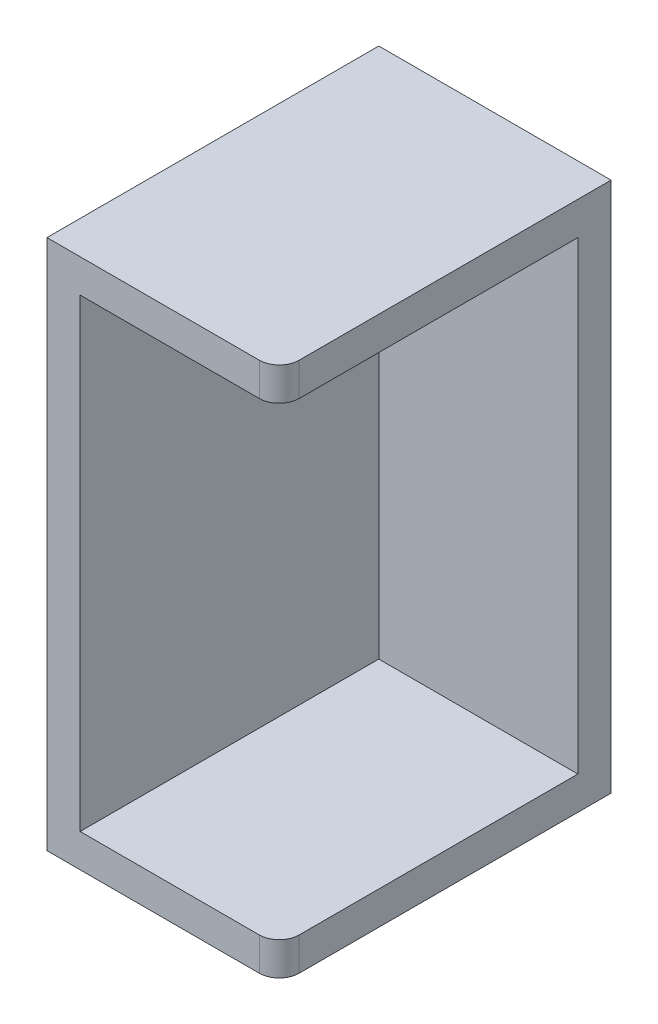
ISO-10303-21;
HEADER;
FILE_DESCRIPTION(('STEP AP214'),'2;1');
FILE_NAME('part.step','',(''),(''),'','','');
FILE_SCHEMA(('AUTOMOTIVE_DESIGN { 1 0 10303 214 1 1 1 1 }'));
ENDSEC;
DATA;
#1=APPLICATION_CONTEXT('core data for automotive mechanical design processes');
#2=APPLICATION_PROTOCOL_DEFINITION('international standard','automotive_design',2000,#1);
#3=PRODUCT_CONTEXT('',#1,'mechanical');
#4=PRODUCT('Part','Part','',(#3));
#5=PRODUCT_RELATED_PRODUCT_CATEGORY('part','',(#4));
#6=PRODUCT_DEFINITION_FORMATION('','',#4);
#7=PRODUCT_DEFINITION_CONTEXT('part definition',#1,'design');
#8=PRODUCT_DEFINITION('design','',#6,#7);
#9=PRODUCT_DEFINITION_SHAPE('','',#8);
#10=(LENGTH_UNIT() NAMED_UNIT(*) SI_UNIT(.MILLI.,.METRE.));
#11=(NAMED_UNIT(*) PLANE_ANGLE_UNIT() SI_UNIT($,.RADIAN.));
#12=(NAMED_UNIT(*) SI_UNIT($,.STERADIAN.) SOLID_ANGLE_UNIT());
#13=UNCERTAINTY_MEASURE_WITH_UNIT(LENGTH_MEASURE(1.E-05),#10,'distance_accuracy_value','');
#14=(GEOMETRIC_REPRESENTATION_CONTEXT(3) GLOBAL_UNCERTAINTY_ASSIGNED_CONTEXT((#13)) GLOBAL_UNIT_ASSIGNED_CONTEXT((#10,
#11,#12)) REPRESENTATION_CONTEXT('',''));
#15=CARTESIAN_POINT('',(0.,0.,0.));
#16=DIRECTION('',(0.,0.,1.));
#17=DIRECTION('',(1.,0.,0.));
#18=AXIS2_PLACEMENT_3D('',#15,#16,#17);
#19=CARTESIAN_POINT('',(-35.8039930177588,13.2918872266973,5.));
#20=DIRECTION('',(1.,0.,0.));
#21=DIRECTION('',(0.,1.,0.));
#22=AXIS2_PLACEMENT_3D('',#19,#20,#21);
#23=PLANE('',#22);
#24=DIRECTION('',(0.,-1.,0.));
#25=VECTOR('',#24,1.);
#26=CARTESIAN_POINT('',(-35.8039930177588,13.2918872266973,0.));
#27=LINE('',#26,#25);
#28=CARTESIAN_POINT('',(-35.8039930177588,13.2918872266973,0.));
#29=VERTEX_POINT('',#28);
#30=CARTESIAN_POINT('',(-35.8039930177588,-66.7081127733027,0.));
#31=VERTEX_POINT('',#30);
#32=EDGE_CURVE('E212',#29,#31,#27,.T.);
#33=ORIENTED_EDGE('',*,*,#32,.T.);
#34=DIRECTION('',(0.,0.,-1.));
#35=VECTOR('',#34,1.);
#36=CARTESIAN_POINT('',(-35.8039930177588,-66.7081127733027,5.));
#37=LINE('',#36,#35);
#38=CARTESIAN_POINT('',(-35.8039930177588,-66.7081127733027,50.));
#39=VERTEX_POINT('',#38);
#40=EDGE_CURVE('E290',#39,#31,#37,.T.);
#41=ORIENTED_EDGE('',*,*,#40,.F.);
#42=DIRECTION('',(0.,-1.,0.));
#43=VECTOR('',#42,1.);
#44=CARTESIAN_POINT('',(-35.8039930177588,0.,50.));
#45=LINE('',#44,#43);
#46=CARTESIAN_POINT('',(-35.8039930177588,13.2918872266973,50.));
#47=VERTEX_POINT('',#46);
#48=EDGE_CURVE('E242',#47,#39,#45,.T.);
#49=ORIENTED_EDGE('',*,*,#48,.F.);
#50=DIRECTION('',(0.,0.,-1.));
#51=VECTOR('',#50,1.);
#52=CARTESIAN_POINT('',(-35.8039930177588,13.2918872266973,5.));
#53=LINE('',#52,#51);
#54=EDGE_CURVE('E266',#47,#29,#53,.T.);
#55=ORIENTED_EDGE('',*,*,#54,.T.);
#56=EDGE_LOOP('',(#33,#41,#49,#55));
#57=FACE_BOUND('',#56,.T.);
#58=ADVANCED_FACE('F124',(#57),#23,.F.);
#59=CARTESIAN_POINT('',(-35.8039930177588,-66.7081127733027,5.));
#60=DIRECTION('',(0.,1.,0.));
#61=DIRECTION('',(0.,0.,1.));
#62=AXIS2_PLACEMENT_3D('',#59,#60,#61);
#63=PLANE('',#62);
#64=DIRECTION('',(0.,0.,-1.));
#65=VECTOR('',#64,1.);
#66=CARTESIAN_POINT('',(-0.803993017758818,-66.7081127733027,5.));
#67=LINE('',#66,#65);
#68=CARTESIAN_POINT('',(-0.803993017758818,-66.7081127733027,47.));
#69=VERTEX_POINT('',#68);
#70=CARTESIAN_POINT('',(-0.803993017758818,-66.7081127733027,0.));
#71=VERTEX_POINT('',#70);
#72=EDGE_CURVE('E287',#69,#71,#67,.T.);
#73=ORIENTED_EDGE('',*,*,#72,.F.);
#74=CARTESIAN_POINT('',(-3.80399301775882,-66.7081127733027,47.));
#75=DIRECTION('',(0.,1.,0.));
#76=DIRECTION('',(0.,0.,1.));
#77=AXIS2_PLACEMENT_3D('',#74,#75,#76);
#78=CIRCLE('',#77,3.);
#79=CARTESIAN_POINT('',(-3.80399301775882,-66.7081127733027,50.));
#80=VERTEX_POINT('',#79);
#81=EDGE_CURVE('E12',#69,#80,#78,.F.);
#82=ORIENTED_EDGE('',*,*,#81,.T.);
#83=DIRECTION('',(1.,0.,0.));
#84=VECTOR('',#83,1.);
#85=CARTESIAN_POINT('',(0.,-66.7081127733027,50.));
#86=LINE('',#85,#84);
#87=EDGE_CURVE('E246',#39,#80,#86,.T.);
#88=ORIENTED_EDGE('',*,*,#87,.F.);
#89=ORIENTED_EDGE('',*,*,#40,.T.);
#90=DIRECTION('',(1.,0.,0.));
#91=VECTOR('',#90,1.);
#92=CARTESIAN_POINT('',(-35.8039930177588,-66.7081127733027,0.));
#93=LINE('',#92,#91);
#94=EDGE_CURVE('E271',#31,#71,#93,.T.);
#95=ORIENTED_EDGE('',*,*,#94,.T.);
#96=EDGE_LOOP('',(#73,#82,#88,#89,#95));
#97=FACE_BOUND('',#96,.T.);
#98=ADVANCED_FACE('F329',(#97),#63,.F.);
#99=CARTESIAN_POINT('',(-0.803993017758825,13.2918872266973,5.));
#100=DIRECTION('',(-1.,0.,0.));
#101=DIRECTION('',(0.,-1.,0.));
#102=AXIS2_PLACEMENT_3D('',#99,#100,#101);
#103=PLANE('',#102);
#104=DIRECTION('',(0.,0.,-1.));
#105=VECTOR('',#104,1.);
#106=CARTESIAN_POINT('',(-0.803993017758825,13.2918872266973,5.));
#107=LINE('',#106,#105);
#108=CARTESIAN_POINT('',(-0.803993017758825,13.2918872266973,47.));
#109=VERTEX_POINT('',#108);
#110=CARTESIAN_POINT('',(-0.803993017758825,13.2918872266973,0.));
#111=VERTEX_POINT('',#110);
#112=EDGE_CURVE('E284',#109,#111,#107,.T.);
#113=ORIENTED_EDGE('',*,*,#112,.F.);
#114=DIRECTION('',(0.,1.,0.));
#115=VECTOR('',#114,1.);
#116=CARTESIAN_POINT('',(-0.803993017758825,8.29188722669734,47.));
#117=LINE('',#116,#115);
#118=CARTESIAN_POINT('',(-0.803993017758825,8.29188722669734,47.));
#119=VERTEX_POINT('',#118);
#120=EDGE_CURVE('E305',#109,#119,#117,.F.);
#121=ORIENTED_EDGE('',*,*,#120,.T.);
#122=DIRECTION('',(0.,0.,-1.));
#123=VECTOR('',#122,1.);
#124=CARTESIAN_POINT('',(-0.803993017758825,8.29188722669734,50.));
#125=LINE('',#124,#123);
#126=CARTESIAN_POINT('',(-0.803993017758825,8.29188722669734,5.));
#127=VERTEX_POINT('',#126);
#128=EDGE_CURVE('E213',#119,#127,#125,.T.);
#129=ORIENTED_EDGE('',*,*,#128,.T.);
#130=DIRECTION('',(0.,1.,0.));
#131=VECTOR('',#130,1.);
#132=CARTESIAN_POINT('',(-0.803993017758825,13.2918872266973,5.));
#133=LINE('',#132,#131);
#134=CARTESIAN_POINT('',(-0.803993017758818,-61.7081127733027,5.));
#135=VERTEX_POINT('',#134);
#136=EDGE_CURVE('E262',#135,#127,#133,.T.);
#137=ORIENTED_EDGE('',*,*,#136,.F.);
#138=DIRECTION('',(0.,0.,-1.));
#139=VECTOR('',#138,1.);
#140=CARTESIAN_POINT('',(-0.803993017758818,-61.7081127733027,50.));
#141=LINE('',#140,#139);
#142=CARTESIAN_POINT('',(-0.803993017758818,-61.7081127733027,47.));
#143=VERTEX_POINT('',#142);
#144=EDGE_CURVE('E237',#143,#135,#141,.T.);
#145=ORIENTED_EDGE('',*,*,#144,.F.);
#146=DIRECTION('',(0.,1.,0.));
#147=VECTOR('',#146,1.);
#148=CARTESIAN_POINT('',(-0.803993017758818,-66.7081127733027,47.));
#149=LINE('',#148,#147);
#150=EDGE_CURVE('E140',#143,#69,#149,.F.);
#151=ORIENTED_EDGE('',*,*,#150,.T.);
#152=ORIENTED_EDGE('',*,*,#72,.T.);
#153=DIRECTION('',(0.,1.,0.));
#154=VECTOR('',#153,1.);
#155=CARTESIAN_POINT('',(-0.803993017758825,13.2918872266973,0.));
#156=LINE('',#155,#154);
#157=EDGE_CURVE('E275',#71,#111,#156,.T.);
#158=ORIENTED_EDGE('',*,*,#157,.T.);
#159=EDGE_LOOP('',(#113,#121,#129,#137,#145,#151,#152,#158));
#160=FACE_BOUND('',#159,.T.);
#161=ADVANCED_FACE('F312',(#160),#103,.F.);
#162=CARTESIAN_POINT('',(-35.8039930177588,13.2918872266973,5.));
#163=DIRECTION('',(0.,-1.,0.));
#164=DIRECTION('',(0.,0.,-1.));
#165=AXIS2_PLACEMENT_3D('',#162,#163,#164);
#166=PLANE('',#165);
#167=DIRECTION('',(-1.,0.,0.));
#168=VECTOR('',#167,1.);
#169=CARTESIAN_POINT('',(0.,13.2918872266973,50.));
#170=LINE('',#169,#168);
#171=CARTESIAN_POINT('',(-3.80399301775883,13.2918872266973,50.));
#172=VERTEX_POINT('',#171);
#173=EDGE_CURVE('E231',#172,#47,#170,.T.);
#174=ORIENTED_EDGE('',*,*,#173,.F.);
#175=CARTESIAN_POINT('',(-3.80399301775883,13.2918872266973,47.));
#176=DIRECTION('',(0.,-1.,0.));
#177=DIRECTION('',(0.,0.,-1.));
#178=AXIS2_PLACEMENT_3D('',#175,#176,#177);
#179=CIRCLE('',#178,3.);
#180=EDGE_CURVE('E300',#172,#109,#179,.F.);
#181=ORIENTED_EDGE('',*,*,#180,.T.);
#182=ORIENTED_EDGE('',*,*,#112,.T.);
#183=DIRECTION('',(-1.,0.,0.));
#184=VECTOR('',#183,1.);
#185=CARTESIAN_POINT('',(-35.8039930177588,13.2918872266973,0.));
#186=LINE('',#185,#184);
#187=EDGE_CURVE('E267',#111,#29,#186,.T.);
#188=ORIENTED_EDGE('',*,*,#187,.T.);
#189=ORIENTED_EDGE('',*,*,#54,.F.);
#190=EDGE_LOOP('',(#174,#181,#182,#188,#189));
#191=FACE_BOUND('',#190,.T.);
#192=ADVANCED_FACE('F319',(#191),#166,.F.);
#193=CARTESIAN_POINT('',(0.,0.,5.));
#194=DIRECTION('',(0.,0.,1.));
#195=DIRECTION('',(1.,0.,0.));
#196=AXIS2_PLACEMENT_3D('',#193,#194,#195);
#197=PLANE('',#196);
#198=DIRECTION('',(1.,0.,0.));
#199=VECTOR('',#198,1.);
#200=CARTESIAN_POINT('',(0.,8.29188722669734,5.));
#201=LINE('',#200,#199);
#202=CARTESIAN_POINT('',(-30.8039930177588,8.29188722669734,5.));
#203=VERTEX_POINT('',#202);
#204=EDGE_CURVE('E232',#203,#127,#201,.T.);
#205=ORIENTED_EDGE('',*,*,#204,.F.);
#206=DIRECTION('',(0.,1.,0.));
#207=VECTOR('',#206,1.);
#208=CARTESIAN_POINT('',(-30.8039930177588,0.,5.));
#209=LINE('',#208,#207);
#210=CARTESIAN_POINT('',(-30.8039930177588,-61.7081127733027,5.));
#211=VERTEX_POINT('',#210);
#212=EDGE_CURVE('E206',#211,#203,#209,.T.);
#213=ORIENTED_EDGE('',*,*,#212,.F.);
#214=DIRECTION('',(1.,0.,0.));
#215=VECTOR('',#214,1.);
#216=CARTESIAN_POINT('',(0.,-61.7081127733027,5.));
#217=LINE('',#216,#215);
#218=EDGE_CURVE('E252',#211,#135,#217,.T.);
#219=ORIENTED_EDGE('',*,*,#218,.T.);
#220=ORIENTED_EDGE('',*,*,#136,.T.);
#221=EDGE_LOOP('',(#205,#213,#219,#220));
#222=FACE_BOUND('',#221,.T.);
#223=ADVANCED_FACE('F334',(#222),#197,.T.);
#224=CARTESIAN_POINT('',(0.,0.,0.));
#225=DIRECTION('',(0.,0.,1.));
#226=DIRECTION('',(1.,0.,0.));
#227=AXIS2_PLACEMENT_3D('',#224,#225,#226);
#228=PLANE('',#227);
#229=ORIENTED_EDGE('',*,*,#32,.F.);
#230=ORIENTED_EDGE('',*,*,#187,.F.);
#231=ORIENTED_EDGE('',*,*,#157,.F.);
#232=ORIENTED_EDGE('',*,*,#94,.F.);
#233=EDGE_LOOP('',(#229,#230,#231,#232));
#234=FACE_BOUND('',#233,.T.);
#235=ADVANCED_FACE('F332',(#234),#228,.F.);
#236=CARTESIAN_POINT('',(0.,8.29188722669734,50.));
#237=DIRECTION('',(0.,1.,0.));
#238=DIRECTION('',(-1.,0.,0.));
#239=AXIS2_PLACEMENT_3D('',#236,#237,#238);
#240=PLANE('',#239);
#241=ORIENTED_EDGE('',*,*,#128,.F.);
#242=CARTESIAN_POINT('',(-3.80399301775882,8.29188722669734,47.));
#243=DIRECTION('',(0.,1.,0.));
#244=DIRECTION('',(-1.,0.,0.));
#245=AXIS2_PLACEMENT_3D('',#242,#243,#244);
#246=CIRCLE('',#245,3.);
#247=CARTESIAN_POINT('',(-3.80399301775882,8.29188722669734,50.));
#248=VERTEX_POINT('',#247);
#249=EDGE_CURVE('E229',#119,#248,#246,.F.);
#250=ORIENTED_EDGE('',*,*,#249,.T.);
#251=DIRECTION('',(1.,0.,0.));
#252=VECTOR('',#251,1.);
#253=CARTESIAN_POINT('',(0.,8.29188722669734,50.));
#254=LINE('',#253,#252);
#255=CARTESIAN_POINT('',(-30.8039930177588,8.29188722669734,50.));
#256=VERTEX_POINT('',#255);
#257=EDGE_CURVE('E219',#256,#248,#254,.T.);
#258=ORIENTED_EDGE('',*,*,#257,.F.);
#259=DIRECTION('',(0.,0.,-1.));
#260=VECTOR('',#259,1.);
#261=CARTESIAN_POINT('',(-30.8039930177588,8.29188722669734,50.));
#262=LINE('',#261,#260);
#263=EDGE_CURVE('E200',#256,#203,#262,.T.);
#264=ORIENTED_EDGE('',*,*,#263,.T.);
#265=ORIENTED_EDGE('',*,*,#204,.T.);
#266=EDGE_LOOP('',(#241,#250,#258,#264,#265));
#267=FACE_BOUND('',#266,.T.);
#268=ADVANCED_FACE('F227',(#267),#240,.F.);
#269=CARTESIAN_POINT('',(0.,0.,50.));
#270=DIRECTION('',(0.,0.,1.));
#271=DIRECTION('',(1.,0.,0.));
#272=AXIS2_PLACEMENT_3D('',#269,#270,#271);
#273=PLANE('',#272);
#274=ORIENTED_EDGE('',*,*,#257,.T.);
#275=DIRECTION('',(0.,1.,0.));
#276=VECTOR('',#275,1.);
#277=CARTESIAN_POINT('',(-3.80399301775883,13.2918872266973,50.));
#278=LINE('',#277,#276);
#279=EDGE_CURVE('E297',#248,#172,#278,.T.);
#280=ORIENTED_EDGE('',*,*,#279,.T.);
#281=ORIENTED_EDGE('',*,*,#173,.T.);
#282=ORIENTED_EDGE('',*,*,#48,.T.);
#283=ORIENTED_EDGE('',*,*,#87,.T.);
#284=DIRECTION('',(0.,1.,0.));
#285=VECTOR('',#284,1.);
#286=CARTESIAN_POINT('',(-3.80399301775882,-61.7081127733027,50.));
#287=LINE('',#286,#285);
#288=CARTESIAN_POINT('',(-3.80399301775882,-61.7081127733027,50.));
#289=VERTEX_POINT('',#288);
#290=EDGE_CURVE('E294',#80,#289,#287,.T.);
#291=ORIENTED_EDGE('',*,*,#290,.T.);
#292=DIRECTION('',(1.,0.,0.));
#293=VECTOR('',#292,1.);
#294=CARTESIAN_POINT('',(0.,-61.7081127733027,50.));
#295=LINE('',#294,#293);
#296=CARTESIAN_POINT('',(-30.8039930177588,-61.7081127733027,50.));
#297=VERTEX_POINT('',#296);
#298=EDGE_CURVE('E222',#297,#289,#295,.T.);
#299=ORIENTED_EDGE('',*,*,#298,.F.);
#300=DIRECTION('',(0.,1.,0.));
#301=VECTOR('',#300,1.);
#302=CARTESIAN_POINT('',(-30.8039930177588,0.,50.));
#303=LINE('',#302,#301);
#304=EDGE_CURVE('E203',#297,#256,#303,.T.);
#305=ORIENTED_EDGE('',*,*,#304,.T.);
#306=EDGE_LOOP('',(#274,#280,#281,#282,#283,#291,#299,#305));
#307=FACE_BOUND('',#306,.T.);
#308=ADVANCED_FACE('F217',(#307),#273,.T.);
#309=CARTESIAN_POINT('',(0.,-61.7081127733027,50.));
#310=DIRECTION('',(0.,1.,0.));
#311=DIRECTION('',(0.,0.,1.));
#312=AXIS2_PLACEMENT_3D('',#309,#310,#311);
#313=PLANE('',#312);
#314=ORIENTED_EDGE('',*,*,#298,.T.);
#315=CARTESIAN_POINT('',(-3.80399301775882,-61.7081127733027,47.));
#316=DIRECTION('',(0.,1.,0.));
#317=DIRECTION('',(0.,0.,1.));
#318=AXIS2_PLACEMENT_3D('',#315,#316,#317);
#319=CIRCLE('',#318,3.);
#320=EDGE_CURVE('E133',#289,#143,#319,.T.);
#321=ORIENTED_EDGE('',*,*,#320,.T.);
#322=ORIENTED_EDGE('',*,*,#144,.T.);
#323=ORIENTED_EDGE('',*,*,#218,.F.);
#324=DIRECTION('',(0.,0.,-1.));
#325=VECTOR('',#324,1.);
#326=CARTESIAN_POINT('',(-30.8039930177588,-61.7081127733027,50.));
#327=LINE('',#326,#325);
#328=EDGE_CURVE('E224',#297,#211,#327,.T.);
#329=ORIENTED_EDGE('',*,*,#328,.F.);
#330=EDGE_LOOP('',(#314,#321,#322,#323,#329));
#331=FACE_BOUND('',#330,.T.);
#332=ADVANCED_FACE('F341',(#331),#313,.T.);
#333=CARTESIAN_POINT('',(-30.8039930177588,0.,50.));
#334=DIRECTION('',(-1.,0.,0.));
#335=DIRECTION('',(0.,0.,1.));
#336=AXIS2_PLACEMENT_3D('',#333,#334,#335);
#337=PLANE('',#336);
#338=ORIENTED_EDGE('',*,*,#212,.T.);
#339=ORIENTED_EDGE('',*,*,#263,.F.);
#340=ORIENTED_EDGE('',*,*,#304,.F.);
#341=ORIENTED_EDGE('',*,*,#328,.T.);
#342=EDGE_LOOP('',(#338,#339,#340,#341));
#343=FACE_BOUND('',#342,.T.);
#344=ADVANCED_FACE('F202',(#343),#337,.F.);
#345=CARTESIAN_POINT('',(-3.80399301775882,0.,47.));
#346=DIRECTION('',(0.,-1.,0.));
#347=DIRECTION('',(1.,0.,0.));
#348=AXIS2_PLACEMENT_3D('',#345,#346,#347);
#349=CYLINDRICAL_SURFACE('',#348,3.);
#350=ORIENTED_EDGE('',*,*,#249,.F.);
#351=ORIENTED_EDGE('',*,*,#120,.F.);
#352=ORIENTED_EDGE('',*,*,#180,.F.);
#353=ORIENTED_EDGE('',*,*,#279,.F.);
#354=EDGE_LOOP('',(#350,#351,#352,#353));
#355=FACE_BOUND('',#354,.T.);
#356=ADVANCED_FACE('F315',(#355),#349,.T.);
#357=CARTESIAN_POINT('',(-3.80399301775882,0.,47.));
#358=DIRECTION('',(0.,-1.,0.));
#359=DIRECTION('',(1.,0.,0.));
#360=AXIS2_PLACEMENT_3D('',#357,#358,#359);
#361=CYLINDRICAL_SURFACE('',#360,3.);
#362=ORIENTED_EDGE('',*,*,#81,.F.);
#363=ORIENTED_EDGE('',*,*,#150,.F.);
#364=ORIENTED_EDGE('',*,*,#320,.F.);
#365=ORIENTED_EDGE('',*,*,#290,.F.);
#366=EDGE_LOOP('',(#362,#363,#364,#365));
#367=FACE_BOUND('',#366,.T.);
#368=ADVANCED_FACE('F126',(#367),#361,.T.);
#369=CLOSED_SHELL('',(#58,#98,#161,#192,#223,#235,#268,#308,#332,#344,#356,#368));
#370=MANIFOLD_SOLID_BREP('B2',#369);
#371=ADVANCED_BREP_SHAPE_REPRESENTATION('',(#18,#370),#14);
#372=SHAPE_DEFINITION_REPRESENTATION(#9,#371);
ENDSEC;
END-ISO-10303-21;
